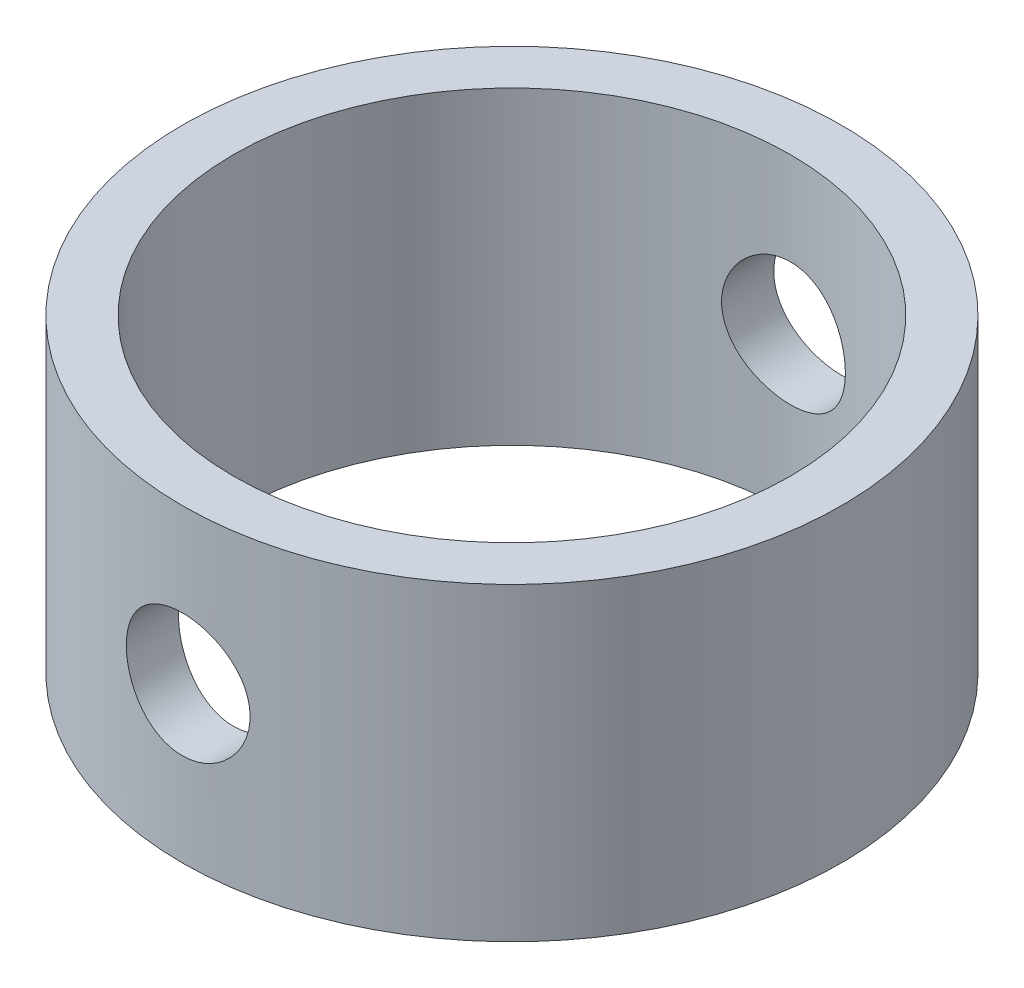
ISO-10303-21;
HEADER;
FILE_DESCRIPTION(('STEP AP214'),'2;1');
FILE_NAME('part.step','',(''),(''),'','','');
FILE_SCHEMA(('AUTOMOTIVE_DESIGN { 1 0 10303 214 1 1 1 1 }'));
ENDSEC;
DATA;
#1=APPLICATION_CONTEXT('core data for automotive mechanical design processes');
#2=APPLICATION_PROTOCOL_DEFINITION('international standard','automotive_design',2000,#1);
#3=PRODUCT_CONTEXT('',#1,'mechanical');
#4=PRODUCT('Part','Part','',(#3));
#5=PRODUCT_RELATED_PRODUCT_CATEGORY('part','',(#4));
#6=PRODUCT_DEFINITION_FORMATION('','',#4);
#7=PRODUCT_DEFINITION_CONTEXT('part definition',#1,'design');
#8=PRODUCT_DEFINITION('design','',#6,#7);
#9=PRODUCT_DEFINITION_SHAPE('','',#8);
#10=(LENGTH_UNIT() NAMED_UNIT(*) SI_UNIT(.MILLI.,.METRE.));
#11=(NAMED_UNIT(*) PLANE_ANGLE_UNIT() SI_UNIT($,.RADIAN.));
#12=(NAMED_UNIT(*) SI_UNIT($,.STERADIAN.) SOLID_ANGLE_UNIT());
#13=UNCERTAINTY_MEASURE_WITH_UNIT(LENGTH_MEASURE(1.E-05),#10,'distance_accuracy_value','');
#14=(GEOMETRIC_REPRESENTATION_CONTEXT(3) GLOBAL_UNCERTAINTY_ASSIGNED_CONTEXT((#13)) GLOBAL_UNIT_ASSIGNED_CONTEXT((#10,
#11,#12)) REPRESENTATION_CONTEXT('',''));
#15=CARTESIAN_POINT('',(0.,0.,0.));
#16=DIRECTION('',(0.,0.,1.));
#17=DIRECTION('',(1.,0.,0.));
#18=AXIS2_PLACEMENT_3D('',#15,#16,#17);
#19=CARTESIAN_POINT('',(0.,-12.7,0.));
#20=DIRECTION('',(0.,1.,0.));
#21=DIRECTION('',(0.,0.,1.));
#22=AXIS2_PLACEMENT_3D('',#19,#20,#21);
#23=CYLINDRICAL_SURFACE('',#22,27.051);
#24=CARTESIAN_POINT('',(5.08000000000002,0.,-26.5697233896028));
#25=CARTESIAN_POINT('',(5.08000256708206,0.141364499653391,-26.569722073654));
#26=CARTESIAN_POINT('',(5.07409757773334,0.282695961559386,-26.5708537218471));
#27=CARTESIAN_POINT('',(5.05052876680062,0.564382181343795,-26.575344123244));
#28=CARTESIAN_POINT('',(5.03286282437892,0.704736758448317,-26.578703278131));
#29=CARTESIAN_POINT('',(4.98589363700969,0.983492781243934,-26.5875540940278));
#30=CARTESIAN_POINT('',(4.95658382509998,1.12189307906085,-26.5930469583778));
#31=CARTESIAN_POINT('',(4.88654366566619,1.39573302550176,-26.6060060896126));
#32=CARTESIAN_POINT('',(4.84580911834365,1.5311715655926,-26.6134730821403));
#33=CARTESIAN_POINT('',(4.75329602318644,1.79790946590104,-26.630151742734));
#34=CARTESIAN_POINT('',(4.70153208780393,1.92921404143337,-26.6393611006094));
#35=CARTESIAN_POINT('',(4.58729153600577,2.18701672087562,-26.6592707738279));
#36=CARTESIAN_POINT('',(4.52481096907546,2.31351303121343,-26.6699716387178));
#37=CARTESIAN_POINT('',(4.38963277045323,2.56073489219014,-26.6925535716701));
#38=CARTESIAN_POINT('',(4.31693988138805,2.68146308687612,-26.7044340911514));
#39=CARTESIAN_POINT('',(4.16179669605856,2.91644956457912,-26.7290519457029));
#40=CARTESIAN_POINT('',(4.07934276225639,3.03070541201994,-26.7417895994235));
#41=CARTESIAN_POINT('',(3.90432108769642,3.25314005445945,-26.7679059367961));
#42=CARTESIAN_POINT('',(3.81165353523558,3.36123968526744,-26.7812900666289));
#43=CARTESIAN_POINT('',(3.61754912714749,3.5693120823927,-26.8081991248317));
#44=CARTESIAN_POINT('',(3.51610903532487,3.66928182297248,-26.8217241035287));
#45=CARTESIAN_POINT('',(3.30520972923538,3.86034036637162,-26.8485284984068));
#46=CARTESIAN_POINT('',(3.1957529323633,3.95143182723533,-26.8618079871138));
#47=CARTESIAN_POINT('',(2.96949244095228,4.12417028590855,-26.8877608808108));
#48=CARTESIAN_POINT('',(2.85268605350478,4.20581379048774,-26.9004340606183));
#49=CARTESIAN_POINT('',(2.61167743929262,4.35960112494206,-26.9249051052745));
#50=CARTESIAN_POINT('',(2.48742746808577,4.43167129505857,-26.9366959088031));
#51=CARTESIAN_POINT('',(2.23313348827631,4.56510058505793,-26.9589691141148));
#52=CARTESIAN_POINT('',(2.10308733260354,4.62645569368581,-26.9694510254887));
#53=CARTESIAN_POINT('',(1.83820533386735,4.73793495022989,-26.9887977985633));
#54=CARTESIAN_POINT('',(1.70337159992896,4.78806397429081,-26.9976633620263));
#55=CARTESIAN_POINT('',(1.42983010742645,4.87675092762048,-27.0135340983942));
#56=CARTESIAN_POINT('',(1.29112095881313,4.91530464522659,-27.0205385940453));
#57=CARTESIAN_POINT('',(0.874048313276515,5.01229063347215,-27.0382882207487));
#58=CARTESIAN_POINT('',(0.59131839076699,5.05348134717586,-27.0460266617099));
#59=CARTESIAN_POINT('',(0.0230176547578063,5.08792837752833,-27.0524852882493));
#60=CARTESIAN_POINT('',(-0.262552914025349,5.08118878817784,-27.0512062440624));
#61=CARTESIAN_POINT('',(-0.824829661191678,5.02045528014284,-27.0398652579797));
#62=CARTESIAN_POINT('',(-1.10160213153865,4.96705607949367,-27.0299138571623));
#63=CARTESIAN_POINT('',(-1.64217617562037,4.8154426096577,-27.0024661072227));
#64=CARTESIAN_POINT('',(-1.90597727515982,4.71722670345078,-26.9849694824972));
#65=CARTESIAN_POINT('',(-2.41485846254721,4.4782059153877,-26.944213575484));
#66=CARTESIAN_POINT('',(-2.65982425022026,4.33716333993054,-26.9209222657255));
#67=CARTESIAN_POINT('',(-3.12283270048111,4.01666683516913,-26.8711522678866));
#68=CARTESIAN_POINT('',(-3.34087261327621,3.83720898782981,-26.844673254808));
#69=CARTESIAN_POINT('',(-3.74736572397886,3.44169860390735,-26.7909799389666));
#70=CARTESIAN_POINT('',(-3.93531221759095,3.22512561840551,-26.7637605910953));
#71=CARTESIAN_POINT('',(-4.27229191544478,2.76326601836816,-26.7120436426619));
#72=CARTESIAN_POINT('',(-4.42132454674342,2.51797898114212,-26.6875460821767));
#73=CARTESIAN_POINT('',(-4.67639129553224,2.0049809622972,-26.6440390319752));
#74=CARTESIAN_POINT('',(-4.78235157764922,1.73723241641905,-26.6250389821175));
#75=CARTESIAN_POINT('',(-4.94763995229856,1.187295721939,-26.5948226204595));
#76=CARTESIAN_POINT('',(-5.00697334654203,0.90510921889272,-26.5836054237269));
#77=CARTESIAN_POINT('',(-5.07658346567403,0.338876603192544,-26.5703999364478));
#78=CARTESIAN_POINT('',(-5.08758826268491,0.0549230976905211,-26.5682746881088));
#79=CARTESIAN_POINT('',(-5.0621806505023,-0.510764089258362,-26.5731272035377));
#80=CARTESIAN_POINT('',(-5.02577059405315,-0.792497880150504,-26.5801045156328));
#81=CARTESIAN_POINT('',(-4.90719193131747,-1.34335340767062,-26.6022483908177));
#82=CARTESIAN_POINT('',(-4.82540517806713,-1.61256033845273,-26.6173465832843));
#83=CARTESIAN_POINT('',(-4.61879991229669,-2.1334495672131,-26.6539721004234));
#84=CARTESIAN_POINT('',(-4.49397821959821,-2.3851305684148,-26.6754999002126));
#85=CARTESIAN_POINT('',(-4.20317148850041,-2.86703065287115,-26.7228707863097));
#86=CARTESIAN_POINT('',(-4.0367266202318,-3.09696753142418,-26.7487609465102));
#87=CARTESIAN_POINT('',(-3.66801717449464,-3.52591122782488,-26.8018069970378));
#88=CARTESIAN_POINT('',(-3.4657493658374,-3.72491525252125,-26.8289630013799));
#89=CARTESIAN_POINT('',(-3.02788737421985,-4.08906555737973,-26.8819212976269));
#90=CARTESIAN_POINT('',(-2.79188273223284,-4.25372212292572,-26.9077005583733));
#91=CARTESIAN_POINT('',(-2.29512614515766,-4.54104567865458,-26.9546122838539));
#92=CARTESIAN_POINT('',(-2.03437515541529,-4.66371428896301,-26.9757449278687));
#93=CARTESIAN_POINT('',(-1.49693379453581,-4.86285166670497,-27.0108854823111));
#94=CARTESIAN_POINT('',(-1.22033474137935,-4.93956068217446,-27.0249303811005));
#95=CARTESIAN_POINT('',(-0.657731159084833,-5.04535136070028,-27.0444627404478));
#96=CARTESIAN_POINT('',(-0.371727626097858,-5.07443805158678,-27.0499511043775));
#97=CARTESIAN_POINT('',(0.0554080703937297,-5.08166432390422,-27.0513147306629));
#98=CARTESIAN_POINT('',(0.196452423067438,-5.07816043934217,-27.0506536333614));
#99=CARTESIAN_POINT('',(0.477720775477603,-5.05944729260677,-27.0471457169919));
#100=CARTESIAN_POINT('',(0.617945064979942,-5.04424245270367,-27.0442997236866));
#101=CARTESIAN_POINT('',(0.896624778833353,-5.00223345673672,-27.0364961488673));
#102=CARTESIAN_POINT('',(1.03507956678128,-4.97542524201215,-27.0315378285072));
#103=CARTESIAN_POINT('',(1.30915523943449,-4.91043148254133,-27.0196505689666));
#104=CARTESIAN_POINT('',(1.44477712151584,-4.87225001674715,-27.0127223363243));
#105=CARTESIAN_POINT('',(1.71209617462916,-4.78485881709987,-26.997096724828));
#106=CARTESIAN_POINT('',(1.84379871098829,-4.7356650272703,-26.9884019053641));
#107=CARTESIAN_POINT('',(2.10253584930964,-4.62660198135007,-26.9694784045542));
#108=CARTESIAN_POINT('',(2.22957209340055,-4.56673652501873,-26.959250269367));
#109=CARTESIAN_POINT('',(2.47822087568244,-4.4367231080215,-26.9375315398434));
#110=CARTESIAN_POINT('',(2.59983119948128,-4.36657099840115,-26.9260404365799));
#111=CARTESIAN_POINT('',(2.83672368443914,-4.21652115979724,-26.9021146032735));
#112=CARTESIAN_POINT('',(2.9520080210297,-4.13662681189584,-26.8896802011691));
#113=CARTESIAN_POINT('',(3.17718344757182,-3.96637363161052,-26.8640119394122));
#114=CARTESIAN_POINT('',(3.28697010564954,-3.8758780146352,-26.8507690028723));
#115=CARTESIAN_POINT('',(3.49851447866629,-3.68605288681,-26.8240258542689));
#116=CARTESIAN_POINT('',(3.60027501869095,-3.58672651069182,-26.8105257348263));
#117=CARTESIAN_POINT('',(3.79518020656133,-3.37982514835551,-26.7836310923852));
#118=CARTESIAN_POINT('',(3.88831966421296,-3.27224526359186,-26.7702366373819));
#119=CARTESIAN_POINT('',(4.06524210713817,-3.04965754741676,-26.7439414759895));
#120=CARTESIAN_POINT('',(4.14902852229536,-2.93465246350498,-26.7310405897505));
#121=CARTESIAN_POINT('',(4.3074638568949,-2.69680725108129,-26.7059703792113));
#122=CARTESIAN_POINT('',(4.38201640649507,-2.57390202020515,-26.6938093514673));
#123=CARTESIAN_POINT('',(4.52045685768508,-2.32217495860341,-26.6707141991253));
#124=CARTESIAN_POINT('',(4.58434868678364,-2.19335532919965,-26.6597796231797));
#125=CARTESIAN_POINT('',(4.70098554312212,-1.9307407236786,-26.6394602610234));
#126=CARTESIAN_POINT('',(4.75373774384349,-1.79694901507337,-26.6300744783074));
#127=CARTESIAN_POINT('',(4.8477286781571,-1.52531565586259,-26.6131245855356));
#128=CARTESIAN_POINT('',(4.88896973584028,-1.38747482899134,-26.6055601078023));
#129=CARTESIAN_POINT('',(4.9758861164288,-1.04451436024711,-26.589470971455));
#130=CARTESIAN_POINT('',(5.01487810002878,-0.837607352946478,-26.5821046453276));
#131=CARTESIAN_POINT('',(5.06693277852335,-0.420442490786676,-26.5722318992123));
#132=CARTESIAN_POINT('',(5.07999618318998,-0.210184727810328,-26.5697253461924));
#133=CARTESIAN_POINT('',(5.08000000000002,0.,-26.5697233896028));
#134=B_SPLINE_CURVE_WITH_KNOTS('',3,(#24,#25,#26,#27,#28,#29,#30,#31,#32,#33,#34,#35,#36,#37,
#38,#39,#40,#41,#42,#43,#44,#45,#46,#47,#48,#49,#50,#51,#52,#53,#54,#55,#56,#57,#58,#59,#60,#61,
#62,#63,#64,#65,#66,#67,#68,#69,#70,#71,#72,#73,#74,#75,#76,#77,#78,#79,#80,#81,#82,#83,#84,#85,
#86,#87,#88,#89,#90,#91,#92,#93,#94,#95,#96,#97,#98,#99,#100,#101,#102,#103,#104,#105,#106,#107,
#108,#109,#110,#111,#112,#113,#114,#115,#116,#117,#118,#119,#120,#121,#122,#123,#124,#125,#126,
#127,#128,#129,#130,#131,#132,#133),.UNSPECIFIED.,.T.,.F.,(4,2,2,2,2,2,2,2,2,2,2,2,2,2,2,2,2,2,
2,2,2,2,2,2,2,2,2,2,2,2,2,2,2,2,2,2,2,2,2,2,2,2,2,2,2,2,2,2,2,2,2,2,2,2,4),(0.,
0.423908911598091,0.847894286864987,1.27211912356616,1.69650011261809,2.12032231179116,
2.54430108334431,2.96808360505442,3.39202455309994,3.82055424178395,4.2492426952525,
4.67780240803715,5.10652007103647,5.53836582317089,5.97037289471618,6.4021919548047,
6.83416794191157,7.68710968204359,8.5399785684283,9.38213289548187,10.2243179863751,
11.0712655079208,11.9182994521921,12.778362750594,13.6384387113101,14.499982874108,
15.3614290608316,16.2098520084506,17.0582328585819,17.8995804043814,18.7409901370692,
19.5921411183092,20.4433689115413,21.3060094052935,22.1686166098914,23.0266743837271,
23.8846415604102,24.3074972051029,24.7301931137694,25.1530369938221,25.5757294055285,
25.9978137418792,26.4197480897533,26.8418530884946,27.2638120087584,27.6919852208579,
28.1200070428486,28.5482848953963,28.9764051732761,29.4086723568476,29.8407799358519,
30.2726084002869,30.7043496157173,31.3346466035121,31.9649263372436),.UNSPECIFIED.);
#135=CARTESIAN_POINT('',(5.08000000000002,0.,-26.5697233896028));
#136=VERTEX_POINT('',#135);
#137=EDGE_CURVE('E91',#136,#136,#134,.T.);
#138=ORIENTED_EDGE('',*,*,#137,.T.);
#139=EDGE_LOOP('',(#138));
#140=FACE_BOUND('',#139,.T.);
#141=CARTESIAN_POINT('',(0.,12.7,0.));
#142=DIRECTION('',(0.,1.,0.));
#143=DIRECTION('',(0.,0.,1.));
#144=AXIS2_PLACEMENT_3D('',#141,#142,#143);
#145=CIRCLE('',#144,27.051);
#146=CARTESIAN_POINT('',(0.,12.7,27.0510000000001));
#147=VERTEX_POINT('',#146);
#148=EDGE_CURVE('E49',#147,#147,#145,.T.);
#149=ORIENTED_EDGE('',*,*,#148,.F.);
#150=EDGE_LOOP('',(#149));
#151=FACE_BOUND('',#150,.T.);
#152=CARTESIAN_POINT('',(0.,-12.7,0.));
#153=DIRECTION('',(0.,1.,0.));
#154=DIRECTION('',(0.,0.,1.));
#155=AXIS2_PLACEMENT_3D('',#152,#153,#154);
#156=CIRCLE('',#155,27.051);
#157=CARTESIAN_POINT('',(0.,-12.7,27.0510000000001));
#158=VERTEX_POINT('',#157);
#159=EDGE_CURVE('E10',#158,#158,#156,.T.);
#160=ORIENTED_EDGE('',*,*,#159,.T.);
#161=EDGE_LOOP('',(#160));
#162=FACE_BOUND('',#161,.T.);
#163=CARTESIAN_POINT('',(-5.07999999999999,0.,26.5697233896029));
#164=CARTESIAN_POINT('',(-5.08000256708203,-0.14136449965339,26.5697220736542));
#165=CARTESIAN_POINT('',(-5.07409757773327,-0.282695961559385,26.5708537218471));
#166=CARTESIAN_POINT('',(-5.05052876680054,-0.564382181343792,26.575344123244));
#167=CARTESIAN_POINT('',(-5.03286282437884,-0.704736758448312,26.578703278131));
#168=CARTESIAN_POINT('',(-4.98589363700962,-0.983492781243932,26.5875540940278));
#169=CARTESIAN_POINT('',(-4.95658382509992,-1.12189307906086,26.5930469583778));
#170=CARTESIAN_POINT('',(-4.88654366566611,-1.39573302550176,26.6060060896126));
#171=CARTESIAN_POINT('',(-4.84580911834354,-1.5311715655926,26.6134730821402));
#172=CARTESIAN_POINT('',(-4.75329602318633,-1.79790946590104,26.630151742734));
#173=CARTESIAN_POINT('',(-4.70153208780385,-1.92921404143337,26.6393611006094));
#174=CARTESIAN_POINT('',(-4.58729153600571,-2.18701672087562,26.6592707738279));
#175=CARTESIAN_POINT('',(-4.52481096907539,-2.31351303121343,26.6699716387178));
#176=CARTESIAN_POINT('',(-4.38963277045316,-2.56073489219014,26.6925535716701));
#177=CARTESIAN_POINT('',(-4.31693988138797,-2.6814630868761,26.7044340911514));
#178=CARTESIAN_POINT('',(-4.16179669605851,-2.91644956457912,26.7290519457029));
#179=CARTESIAN_POINT('',(-4.07934276225639,-3.03070541201995,26.7417895994235));
#180=CARTESIAN_POINT('',(-3.90432108769642,-3.25314005445946,26.7679059367961));
#181=CARTESIAN_POINT('',(-3.81165353523554,-3.36123968526743,26.7812900666289));
#182=CARTESIAN_POINT('',(-3.61754912714742,-3.56931208239268,26.8081991248317));
#183=CARTESIAN_POINT('',(-3.51610903532481,-3.66928182297247,26.8217241035287));
#184=CARTESIAN_POINT('',(-3.30520972923532,-3.86034036637162,26.8485284984068));
#185=CARTESIAN_POINT('',(-3.19575293236323,-3.95143182723534,26.8618079871138));
#186=CARTESIAN_POINT('',(-2.9694924409522,-4.12417028590856,26.8877608808108));
#187=CARTESIAN_POINT('',(-2.85268605350469,-4.20581379048774,26.9004340606184));
#188=CARTESIAN_POINT('',(-2.61167743929252,-4.35960112494206,26.9249051052746));
#189=CARTESIAN_POINT('',(-2.48742746808567,-4.43167129505859,26.9366959088032));
#190=CARTESIAN_POINT('',(-2.23313348827621,-4.56510058505795,26.9589691141148));
#191=CARTESIAN_POINT('',(-2.10308733260344,-4.62645569368582,26.9694510254887));
#192=CARTESIAN_POINT('',(-1.83820533386725,-4.7379349502299,26.9887977985634));
#193=CARTESIAN_POINT('',(-1.70337159992886,-4.78806397429083,26.9976633620263));
#194=CARTESIAN_POINT('',(-1.42983010742635,-4.87675092762048,27.0135340983942));
#195=CARTESIAN_POINT('',(-1.29112095881304,-4.91530464522659,27.0205385940453));
#196=CARTESIAN_POINT('',(-0.874048313276421,-5.01229063347214,27.0382882207487));
#197=CARTESIAN_POINT('',(-0.591318390766901,-5.05348134717586,27.0460266617099));
#198=CARTESIAN_POINT('',(-0.0230176547577271,-5.08792837752833,27.0524852882493));
#199=CARTESIAN_POINT('',(0.262552914025424,-5.08118878817783,27.0512062440625));
#200=CARTESIAN_POINT('',(0.824829661191746,-5.02045528014283,27.0398652579798));
#201=CARTESIAN_POINT('',(1.10160213153872,-4.96705607949367,27.0299138571623));
#202=CARTESIAN_POINT('',(1.64217617562044,-4.8154426096577,27.0024661072226));
#203=CARTESIAN_POINT('',(1.90597727515989,-4.71722670345079,26.9849694824972));
#204=CARTESIAN_POINT('',(2.41485846254729,-4.47820591538769,26.944213575484));
#205=CARTESIAN_POINT('',(2.65982425022035,-4.33716333993052,26.9209222657255));
#206=CARTESIAN_POINT('',(3.12283270048122,-4.01666683516912,26.8711522678866));
#207=CARTESIAN_POINT('',(3.34087261327635,-3.83720898782981,26.8446732548079));
#208=CARTESIAN_POINT('',(3.74736572397899,-3.44169860390736,26.7909799389665));
#209=CARTESIAN_POINT('',(3.93531221759105,-3.22512561840551,26.7637605910953));
#210=CARTESIAN_POINT('',(4.27229191544482,-2.76326601836815,26.7120436426619));
#211=CARTESIAN_POINT('',(4.42132454674343,-2.51797898114211,26.6875460821768));
#212=CARTESIAN_POINT('',(4.67639129553225,-2.00498096229719,26.6440390319753));
#213=CARTESIAN_POINT('',(4.78235157764926,-1.73723241641905,26.6250389821175));
#214=CARTESIAN_POINT('',(4.94763995229866,-1.187295721939,26.5948226204595));
#215=CARTESIAN_POINT('',(5.00697334654216,-0.905109218892723,26.5836054237269));
#216=CARTESIAN_POINT('',(5.07658346567416,-0.338876603192546,26.5703999364478));
#217=CARTESIAN_POINT('',(5.087588262685,-0.0549230976905234,26.5682746881088));
#218=CARTESIAN_POINT('',(5.06218065050235,0.510764089258358,26.5731272035376));
#219=CARTESIAN_POINT('',(5.02577059405317,0.7924978801505,26.5801045156327));
#220=CARTESIAN_POINT('',(4.9071919313175,1.34335340767062,26.6022483908176));
#221=CARTESIAN_POINT('',(4.82540517806718,1.61256033845274,26.6173465832843));
#222=CARTESIAN_POINT('',(4.61879991229676,2.13344956721311,26.6539721004234));
#223=CARTESIAN_POINT('',(4.49397821959828,2.3851305684148,26.6754999002127));
#224=CARTESIAN_POINT('',(4.20317148850048,2.86703065287115,26.7228707863098));
#225=CARTESIAN_POINT('',(4.03672662023186,3.09696753142419,26.7487609465102));
#226=CARTESIAN_POINT('',(3.6680171744947,3.52591122782489,26.8018069970378));
#227=CARTESIAN_POINT('',(3.46574936583745,3.72491525252125,26.8289630013799));
#228=CARTESIAN_POINT('',(3.0278873742199,4.08906555737973,26.8819212976269));
#229=CARTESIAN_POINT('',(2.7918827322329,4.25372212292573,26.9077005583733));
#230=CARTESIAN_POINT('',(2.29512614515772,4.54104567865459,26.9546122838539));
#231=CARTESIAN_POINT('',(2.03437515541535,4.66371428896302,26.9757449278687));
#232=CARTESIAN_POINT('',(1.49693379453587,4.86285166670497,27.0108854823112));
#233=CARTESIAN_POINT('',(1.22033474137943,4.93956068217445,27.0249303811005));
#234=CARTESIAN_POINT('',(0.657731159084935,5.04535136070028,27.0444627404478));
#235=CARTESIAN_POINT('',(0.371727626097971,5.07443805158678,27.0499511043775));
#236=CARTESIAN_POINT('',(-0.0554080703936131,5.08166432390422,27.0513147306629));
#237=CARTESIAN_POINT('',(-0.19645242306733,5.07816043934217,27.0506536333614));
#238=CARTESIAN_POINT('',(-0.477720775477511,5.05944729260677,27.0471457169919));
#239=CARTESIAN_POINT('',(-0.617945064979859,5.04424245270367,27.0442997236866));
#240=CARTESIAN_POINT('',(-0.896624778833288,5.00223345673672,27.0364961488673));
#241=CARTESIAN_POINT('',(-1.03507956678122,4.97542524201214,27.0315378285073));
#242=CARTESIAN_POINT('',(-1.30915523943445,4.91043148254132,27.0196505689665));
#243=CARTESIAN_POINT('',(-1.44477712151581,4.87225001674716,27.0127223363242));
#244=CARTESIAN_POINT('',(-1.71209617462913,4.78485881709988,26.9970967248279));
#245=CARTESIAN_POINT('',(-1.84379871098826,4.73566502727029,26.988401905364));
#246=CARTESIAN_POINT('',(-2.10253584930962,4.62660198135005,26.9694784045543));
#247=CARTESIAN_POINT('',(-2.22957209340053,4.56673652501871,26.959250269367));
#248=CARTESIAN_POINT('',(-2.47822087568241,4.43672310802148,26.9375315398434));
#249=CARTESIAN_POINT('',(-2.59983119948125,4.36657099840112,26.92604043658));
#250=CARTESIAN_POINT('',(-2.83672368443911,4.21652115979722,26.9021146032734));
#251=CARTESIAN_POINT('',(-2.95200802102967,4.13662681189584,26.8896802011689));
#252=CARTESIAN_POINT('',(-3.17718344757178,3.96637363161052,26.864011939412));
#253=CARTESIAN_POINT('',(-3.2869701056495,3.87587801463518,26.8507690028723));
#254=CARTESIAN_POINT('',(-3.49851447866624,3.68605288680996,26.824025854269));
#255=CARTESIAN_POINT('',(-3.60027501869091,3.58672651069179,26.8105257348263));
#256=CARTESIAN_POINT('',(-3.79518020656128,3.37982514835549,26.7836310923852));
#257=CARTESIAN_POINT('',(-3.88831966421291,3.27224526359184,26.7702366373819));
#258=CARTESIAN_POINT('',(-4.06524210713811,3.04965754741674,26.7439414759895));
#259=CARTESIAN_POINT('',(-4.14902852229531,2.93465246350498,26.7310405897504));
#260=CARTESIAN_POINT('',(-4.30746385689485,2.69680725108129,26.7059703792113));
#261=CARTESIAN_POINT('',(-4.382016406495,2.57390202020515,26.6938093514673));
#262=CARTESIAN_POINT('',(-4.52045685768501,2.3221749586034,26.6707141991253));
#263=CARTESIAN_POINT('',(-4.58434868678357,2.19335532919964,26.6597796231798));
#264=CARTESIAN_POINT('',(-4.70098554312205,1.9307407236786,26.6394602610234));
#265=CARTESIAN_POINT('',(-4.75373774384342,1.79694901507338,26.6300744783073));
#266=CARTESIAN_POINT('',(-4.84772867815703,1.52531565586259,26.6131245855356));
#267=CARTESIAN_POINT('',(-4.8889697358402,1.38747482899134,26.6055601078024));
#268=CARTESIAN_POINT('',(-4.97588611642872,1.04451436024711,26.5894709714551));
#269=CARTESIAN_POINT('',(-5.01487810002869,0.837607352946474,26.5821046453276));
#270=CARTESIAN_POINT('',(-5.0669327785233,0.420442490786675,26.5722318992123));
#271=CARTESIAN_POINT('',(-5.07999618318996,0.210184727810326,26.5697253461926));
#272=CARTESIAN_POINT('',(-5.07999999999999,0.,26.5697233896029));
#273=B_SPLINE_CURVE_WITH_KNOTS('',3,(#163,#164,#165,#166,#167,#168,#169,#170,#171,#172,#173,
#174,#175,#176,#177,#178,#179,#180,#181,#182,#183,#184,#185,#186,#187,#188,#189,#190,#191,#192,
#193,#194,#195,#196,#197,#198,#199,#200,#201,#202,#203,#204,#205,#206,#207,#208,#209,#210,#211,
#212,#213,#214,#215,#216,#217,#218,#219,#220,#221,#222,#223,#224,#225,#226,#227,#228,#229,#230,
#231,#232,#233,#234,#235,#236,#237,#238,#239,#240,#241,#242,#243,#244,#245,#246,#247,#248,#249,
#250,#251,#252,#253,#254,#255,#256,#257,#258,#259,#260,#261,#262,#263,#264,#265,#266,#267,#268,
#269,#270,#271,#272),.UNSPECIFIED.,.T.,.F.,(4,2,2,2,2,2,2,2,2,2,2,2,2,2,2,2,2,2,2,2,2,2,2,2,2,2,
2,2,2,2,2,2,2,2,2,2,2,2,2,2,2,2,2,2,2,2,2,2,2,2,2,2,2,2,4),(0.,0.42390891159809,
0.847894286864983,1.27211912356616,1.6965001126181,2.12032231179116,2.54430108334431,
2.9680836050544,3.3920245530999,3.82055424178393,4.24924269525249,4.67780240803717,
5.10652007103651,5.53836582317092,5.97037289471622,6.40219195480473,6.8341679419116,
7.68710968204361,8.5399785684283,9.38213289548186,10.2243179863751,11.0712655079209,
11.9182994521921,12.778362750594,13.6384387113101,14.499982874108,15.3614290608316,
16.2098520084506,17.0582328585819,17.8995804043814,18.7409901370692,19.5921411183092,
20.4433689115413,21.3060094052935,22.1686166098915,23.0266743837271,23.8846415604101,
24.3074972051029,24.7301931137694,25.1530369938221,25.5757294055286,25.9978137418793,
26.4197480897533,26.8418530884947,27.2638120087584,27.691985220858,28.1200070428487,
28.5482848953963,28.9764051732761,29.4086723568476,29.8407799358519,30.2726084002869,
30.7043496157173,31.3346466035122,31.9649263372436),.UNSPECIFIED.);
#274=CARTESIAN_POINT('',(-5.07999999999999,0.,26.5697233896029));
#275=VERTEX_POINT('',#274);
#276=EDGE_CURVE('E60',#275,#275,#273,.T.);
#277=ORIENTED_EDGE('',*,*,#276,.F.);
#278=EDGE_LOOP('',(#277));
#279=FACE_BOUND('',#278,.T.);
#280=ADVANCED_FACE('F36',(#140,#151,#162,#279),#23,.T.);
#281=CARTESIAN_POINT('',(0.,-12.7,0.));
#282=DIRECTION('',(0.,1.,0.));
#283=DIRECTION('',(0.,0.,1.));
#284=AXIS2_PLACEMENT_3D('',#281,#282,#283);
#285=CYLINDRICAL_SURFACE('',#284,22.86);
#286=CARTESIAN_POINT('',(5.08,0.,-22.288409543976));
#287=CARTESIAN_POINT('',(5.07999047367789,0.28153961399861,-22.2884152312016));
#288=CARTESIAN_POINT('',(5.05651549389989,0.563192708152524,-22.2938021321399));
#289=CARTESIAN_POINT('',(4.96334348112367,1.11848093826572,-22.3147264919059));
#290=CARTESIAN_POINT('',(4.89361372561626,1.39211025467659,-22.3302711366183));
#291=CARTESIAN_POINT('',(4.71024301313196,1.92323827256494,-22.3696655063698));
#292=CARTESIAN_POINT('',(4.5966511267355,2.18075462756098,-22.3935059475846));
#293=CARTESIAN_POINT('',(4.32892208725692,2.67308331792509,-22.4467944842288));
#294=CARTESIAN_POINT('',(4.17478549384169,2.90789596662707,-22.4762425022512));
#295=CARTESIAN_POINT('',(3.8274779294618,3.35224773127573,-22.5380017433978));
#296=CARTESIAN_POINT('',(3.6337333923922,3.56133339578411,-22.5703505875779));
#297=CARTESIAN_POINT('',(3.21394754431366,3.94432219119513,-22.6339375475578));
#298=CARTESIAN_POINT('',(2.98790367471455,4.11822253225487,-22.6651755751193));
#299=CARTESIAN_POINT('',(2.50688842090342,4.4277045085441,-22.7234316371639));
#300=CARTESIAN_POINT('',(2.25162926999402,4.56284901361093,-22.7504001025488));
#301=CARTESIAN_POINT('',(1.72132329255597,4.78815349637002,-22.7966530181213));
#302=CARTESIAN_POINT('',(1.44627876353771,4.87831868751638,-22.8159383587908));
#303=CARTESIAN_POINT('',(0.888925822674037,5.00967611966469,-22.8443862254682));
#304=CARTESIAN_POINT('',(0.606806579785341,5.05163609736901,-22.8537072751441));
#305=CARTESIAN_POINT('',(0.0393894507765458,5.08779340801595,-22.8617259033818));
#306=CARTESIAN_POINT('',(-0.245908056510384,5.08199637379189,-22.8604247348108));
#307=CARTESIAN_POINT('',(-0.806287239173196,5.02337394486009,-22.8474663535223));
#308=CARTESIAN_POINT('',(-1.08146033219091,4.97137619110865,-22.8359914019582));
#309=CARTESIAN_POINT('',(-1.61907434768023,4.82314842440987,-22.8041829234791));
#310=CARTESIAN_POINT('',(-1.88151468182671,4.72691636973663,-22.7838489876614));
#311=CARTESIAN_POINT('',(-2.38849857425285,4.49222628578371,-22.7363156805819));
#312=CARTESIAN_POINT('',(-2.63289293307058,4.35345657997755,-22.7090658988343));
#313=CARTESIAN_POINT('',(-3.09522656682394,4.03786316136919,-22.6506855007807));
#314=CARTESIAN_POINT('',(-3.31316212303962,3.86103410908081,-22.6195543401998));
#315=CARTESIAN_POINT('',(-3.72131587353456,3.46984270761501,-22.5560424094361));
#316=CARTESIAN_POINT('',(-3.91083855492697,3.25475606103979,-22.5236491602921));
#317=CARTESIAN_POINT('',(-4.25125649672445,2.79551702104693,-22.4618885647179));
#318=CARTESIAN_POINT('',(-4.40215064066947,2.55136378783195,-22.432521305761));
#319=CARTESIAN_POINT('',(-4.66135125425858,2.03977268361077,-22.3801034121955));
#320=CARTESIAN_POINT('',(-4.76952252696271,1.77226411414576,-22.3570728989307));
#321=CARTESIAN_POINT('',(-4.93916384585617,1.22223232501494,-22.3202122568124));
#322=CARTESIAN_POINT('',(-5.00064156512187,0.939711580443438,-22.3063806163695));
#323=CARTESIAN_POINT('',(-5.07406399207373,0.374040432843349,-22.2897930756174));
#324=CARTESIAN_POINT('',(-5.08702306870319,0.0910281871373733,-22.2868103967558));
#325=CARTESIAN_POINT('',(-5.06578990457561,-0.473112904332455,-22.2916461571674));
#326=CARTESIAN_POINT('',(-5.03160101596522,-0.754241882565719,-22.2994638285527));
#327=CARTESIAN_POINT('',(-4.91792354799788,-1.30307978523382,-22.3248049386566));
#328=CARTESIAN_POINT('',(-4.83899699342299,-1.57091119725058,-22.342207885319));
#329=CARTESIAN_POINT('',(-4.6386946885232,-2.08954784306887,-22.3846493759229));
#330=CARTESIAN_POINT('',(-4.51731476799421,-2.34035140132916,-22.4096886699537));
#331=CARTESIAN_POINT('',(-4.23332834223041,-2.82219298851157,-22.4650776009463));
#332=CARTESIAN_POINT('',(-4.07009890755946,-3.05285474006194,-22.4955051141663));
#333=CARTESIAN_POINT('',(-3.70785908906177,-3.48388522781824,-22.5580382471257));
#334=CARTESIAN_POINT('',(-3.50884411140852,-3.68425006869263,-22.5901440819372));
#335=CARTESIAN_POINT('',(-3.07608532512109,-4.05295441251177,-22.6531661217547));
#336=CARTESIAN_POINT('',(-2.84174542098411,-4.22060125110842,-22.6840474113811));
#337=CARTESIAN_POINT('',(-2.34764113184216,-4.51414930095443,-22.7404907506628));
#338=CARTESIAN_POINT('',(-2.08787795482517,-4.64005249440896,-22.7660530528697));
#339=CARTESIAN_POINT('',(-1.55194482600837,-4.84558369116886,-22.8088314134776));
#340=CARTESIAN_POINT('',(-1.27589378596299,-4.92551007757118,-22.8261011655522));
#341=CARTESIAN_POINT('',(-0.7138545204608,-5.03774750644199,-22.8505810881676));
#342=CARTESIAN_POINT('',(-0.427867795329976,-5.07006570621316,-22.857792770806));
#343=CARTESIAN_POINT('',(0.139356707672544,-5.08583890721716,-22.8612973100871));
#344=CARTESIAN_POINT('',(0.42056483256994,-5.07032674187453,-22.8578209652544));
#345=CARTESIAN_POINT('',(0.976259265070024,-4.99319562558586,-22.8408363721633));
#346=CARTESIAN_POINT('',(1.25074570105196,-4.93157755593861,-22.8273283156577));
#347=CARTESIAN_POINT('',(1.78437612335807,-4.76448537272543,-22.791817181437));
#348=CARTESIAN_POINT('',(2.04356940190698,-4.65916207129219,-22.7698433348125));
#349=CARTESIAN_POINT('',(2.5407404813563,-4.4077945790098,-22.7197434178724));
#350=CARTESIAN_POINT('',(2.77871614890838,-4.26174629950223,-22.6916167298921));
#351=CARTESIAN_POINT('',(3.23172048475534,-3.9297298152438,-22.6315900584347));
#352=CARTESIAN_POINT('',(3.44621042631806,-3.74303788934882,-22.5996271269518));
#353=CARTESIAN_POINT('',(3.84117020017682,-3.33648777341103,-22.5358631623133));
#354=CARTESIAN_POINT('',(4.02163178397831,-3.11662156509317,-22.5040621702248));
#355=CARTESIAN_POINT('',(4.3458346190064,-2.6462875705386,-22.4437288022287));
#356=CARTESIAN_POINT('',(4.48903054079255,-2.39543687347865,-22.415248009314));
#357=CARTESIAN_POINT('',(4.73100466864656,-1.87264828575723,-22.3654325407368));
#358=CARTESIAN_POINT('',(4.82981992564187,-1.60072820797164,-22.3440919079659));
#359=CARTESIAN_POINT('',(4.96288947642972,-1.10716955589966,-22.3148555922063));
#360=CARTESIAN_POINT('',(5.00672054401883,-0.888178494725339,-22.3050050346657));
#361=CARTESIAN_POINT('',(5.06527882473345,-0.446148570286355,-22.2917799252447));
#362=CARTESIAN_POINT('',(5.08000754926425,-0.223109917837044,-22.2884050370562));
#363=CARTESIAN_POINT('',(5.08,0.,-22.288409543976));
#364=B_SPLINE_CURVE_WITH_KNOTS('',3,(#286,#287,#288,#289,#290,#291,#292,#293,#294,#295,#296,
#297,#298,#299,#300,#301,#302,#303,#304,#305,#306,#307,#308,#309,#310,#311,#312,#313,#314,#315,
#316,#317,#318,#319,#320,#321,#322,#323,#324,#325,#326,#327,#328,#329,#330,#331,#332,#333,#334,
#335,#336,#337,#338,#339,#340,#341,#342,#343,#344,#345,#346,#347,#348,#349,#350,#351,#352,#353,
#354,#355,#356,#357,#358,#359,#360,#361,#362,#363),.UNSPECIFIED.,.T.,.F.,(4,2,2,2,2,2,2,2,2,2,2,
2,2,2,2,2,2,2,2,2,2,2,2,2,2,2,2,2,2,2,2,2,2,2,2,2,2,2,4),(0.,0.843800997232452,1.68819957113255,
2.53165620179761,3.37510119025267,4.23175668555893,5.0884800784501,5.95451724112734,
6.82045399999093,7.6723994755663,8.52424446750646,9.36113042275914,10.1980550100983,
11.0412646333649,11.8845926308202,12.7460260013687,13.6074842666569,14.4716471920553,
15.3356680802104,16.181520837791,17.0273134596631,17.8627089520477,18.6981865285854,
19.5469060097684,20.3957345198163,21.2609441696058,22.1261127288594,22.9856012082732,
23.8449604610211,24.6858939242577,25.5268113137455,26.3648507952952,27.2029744436582,
28.0574615242517,28.9121554675119,29.7787306771007,30.6445810807345,31.3132974521028,
31.9819790933452),.UNSPECIFIED.);
#365=CARTESIAN_POINT('',(5.08,0.,-22.288409543976));
#366=VERTEX_POINT('',#365);
#367=EDGE_CURVE('E88',#366,#366,#364,.T.);
#368=ORIENTED_EDGE('',*,*,#367,.F.);
#369=EDGE_LOOP('',(#368));
#370=FACE_BOUND('',#369,.T.);
#371=CARTESIAN_POINT('',(0.,12.7,0.));
#372=DIRECTION('',(0.,1.,0.));
#373=DIRECTION('',(0.,0.,1.));
#374=AXIS2_PLACEMENT_3D('',#371,#372,#373);
#375=CIRCLE('',#374,22.86);
#376=CARTESIAN_POINT('',(0.,12.7,22.8600000000001));
#377=VERTEX_POINT('',#376);
#378=EDGE_CURVE('E54',#377,#377,#375,.T.);
#379=ORIENTED_EDGE('',*,*,#378,.T.);
#380=EDGE_LOOP('',(#379));
#381=FACE_BOUND('',#380,.T.);
#382=CARTESIAN_POINT('',(0.,-12.7,0.));
#383=DIRECTION('',(0.,1.,0.));
#384=DIRECTION('',(0.,0.,1.));
#385=AXIS2_PLACEMENT_3D('',#382,#383,#384);
#386=CIRCLE('',#385,22.86);
#387=CARTESIAN_POINT('',(0.,-12.7,22.8600000000001));
#388=VERTEX_POINT('',#387);
#389=EDGE_CURVE('E43',#388,#388,#386,.T.);
#390=ORIENTED_EDGE('',*,*,#389,.F.);
#391=EDGE_LOOP('',(#390));
#392=FACE_BOUND('',#391,.T.);
#393=CARTESIAN_POINT('',(-5.07999999999998,0.,22.288409543976));
#394=CARTESIAN_POINT('',(-5.07999047367788,-0.281539613998609,22.2884152312017));
#395=CARTESIAN_POINT('',(-5.05651549389984,-0.563192708152524,22.29380213214));
#396=CARTESIAN_POINT('',(-4.96334348112357,-1.11848093826572,22.3147264919059));
#397=CARTESIAN_POINT('',(-4.89361372561613,-1.39211025467659,22.3302711366183));
#398=CARTESIAN_POINT('',(-4.71024301313183,-1.92323827256493,22.3696655063698));
#399=CARTESIAN_POINT('',(-4.59665112673541,-2.18075462756099,22.3935059475847));
#400=CARTESIAN_POINT('',(-4.32892208725686,-2.67308331792509,22.4467944842288));
#401=CARTESIAN_POINT('',(-4.17478549384163,-2.90789596662707,22.4762425022512));
#402=CARTESIAN_POINT('',(-3.82747792946174,-3.35224773127572,22.5380017433978));
#403=CARTESIAN_POINT('',(-3.63373339239214,-3.5613333957841,22.5703505875779));
#404=CARTESIAN_POINT('',(-3.2139475443136,-3.94432219119513,22.6339375475579));
#405=CARTESIAN_POINT('',(-2.98790367471449,-4.11822253225487,22.6651755751194));
#406=CARTESIAN_POINT('',(-2.50688842090337,-4.4277045085441,22.723431637164));
#407=CARTESIAN_POINT('',(-2.25162926999396,-4.56284901361092,22.7504001025489));
#408=CARTESIAN_POINT('',(-1.72132329255591,-4.78815349637002,22.7966530181213));
#409=CARTESIAN_POINT('',(-1.44627876353765,-4.87831868751638,22.8159383587908));
#410=CARTESIAN_POINT('',(-0.888925822673976,-5.00967611966469,22.8443862254682));
#411=CARTESIAN_POINT('',(-0.606806579785273,-5.05163609736901,22.853707275144));
#412=CARTESIAN_POINT('',(-0.039389450776465,-5.08779340801595,22.8617259033818));
#413=CARTESIAN_POINT('',(0.24590805651047,-5.0819963737919,22.8604247348109));
#414=CARTESIAN_POINT('',(0.806287239173282,-5.02337394486009,22.8474663535224));
#415=CARTESIAN_POINT('',(1.08146033219099,-4.97137619110865,22.8359914019583));
#416=CARTESIAN_POINT('',(1.61907434768031,-4.82314842440987,22.804182923479));
#417=CARTESIAN_POINT('',(1.88151468182678,-4.72691636973662,22.7838489876614));
#418=CARTESIAN_POINT('',(2.38849857425292,-4.4922262857837,22.7363156805819));
#419=CARTESIAN_POINT('',(2.63289293307065,-4.35345657997754,22.7090658988343));
#420=CARTESIAN_POINT('',(3.09522656682403,-4.03786316136918,22.6506855007807));
#421=CARTESIAN_POINT('',(3.31316212303974,-3.86103410908081,22.6195543401999));
#422=CARTESIAN_POINT('',(3.72131587353467,-3.469842707615,22.5560424094362));
#423=CARTESIAN_POINT('',(3.91083855492705,-3.25475606103976,22.5236491602921));
#424=CARTESIAN_POINT('',(4.25125649672454,-2.79551702104691,22.4618885647179));
#425=CARTESIAN_POINT('',(4.4021506406696,-2.55136378783195,22.4325213057609));
#426=CARTESIAN_POINT('',(4.6613512542587,-2.03977268361077,22.3801034121954));
#427=CARTESIAN_POINT('',(4.76952252696279,-1.77226411414575,22.3570728989306));
#428=CARTESIAN_POINT('',(4.93916384585623,-1.22223232501493,22.3202122568124));
#429=CARTESIAN_POINT('',(5.00064156512195,-0.939711580443434,22.3063806163696));
#430=CARTESIAN_POINT('',(5.07406399207382,-0.374040432843348,22.2897930756175));
#431=CARTESIAN_POINT('',(5.08702306870326,-0.0910281871373705,22.2868103967558));
#432=CARTESIAN_POINT('',(5.06578990457568,0.473112904332458,22.2916461571673));
#433=CARTESIAN_POINT('',(5.03160101596529,0.754241882565721,22.2994638285526));
#434=CARTESIAN_POINT('',(4.91792354799796,1.30307978523382,22.3248049386565));
#435=CARTESIAN_POINT('',(4.83899699342307,1.57091119725059,22.3422078853189));
#436=CARTESIAN_POINT('',(4.63869468852326,2.08954784306888,22.384649375923));
#437=CARTESIAN_POINT('',(4.51731476799424,2.34035140132916,22.4096886699538));
#438=CARTESIAN_POINT('',(4.23332834223043,2.82219298851157,22.4650776009464));
#439=CARTESIAN_POINT('',(4.0700989075595,3.05285474006196,22.4955051141663));
#440=CARTESIAN_POINT('',(3.70785908906183,3.48388522781826,22.5580382471257));
#441=CARTESIAN_POINT('',(3.50884411140857,3.68425006869264,22.5901440819372));
#442=CARTESIAN_POINT('',(3.07608532512114,4.05295441251177,22.6531661217547));
#443=CARTESIAN_POINT('',(2.84174542098417,4.22060125110843,22.6840474113811));
#444=CARTESIAN_POINT('',(2.34764113184223,4.51414930095443,22.7404907506628));
#445=CARTESIAN_POINT('',(2.08787795482524,4.64005249440896,22.7660530528697));
#446=CARTESIAN_POINT('',(1.55194482600844,4.84558369116886,22.8088314134776));
#447=CARTESIAN_POINT('',(1.27589378596306,4.92551007757118,22.8261011655522));
#448=CARTESIAN_POINT('',(0.713854520460866,5.03774750644199,22.8505810881676));
#449=CARTESIAN_POINT('',(0.427867795330044,5.07006570621316,22.8577927708062));
#450=CARTESIAN_POINT('',(-0.139356707672475,5.08583890721716,22.8612973100872));
#451=CARTESIAN_POINT('',(-0.420564832569873,5.07032674187453,22.8578209652545));
#452=CARTESIAN_POINT('',(-0.976259265069963,4.99319562558586,22.8408363721632));
#453=CARTESIAN_POINT('',(-1.2507457010519,4.93157755593862,22.8273283156576));
#454=CARTESIAN_POINT('',(-1.78437612335802,4.76448537272543,22.791817181437));
#455=CARTESIAN_POINT('',(-2.04356940190693,4.65916207129217,22.7698433348125));
#456=CARTESIAN_POINT('',(-2.54074048135628,4.40779457900978,22.7197434178724));
#457=CARTESIAN_POINT('',(-2.77871614890838,4.26174629950223,22.6916167298921));
#458=CARTESIAN_POINT('',(-3.23172048475534,3.9297298152438,22.6315900584347));
#459=CARTESIAN_POINT('',(-3.44621042631803,3.74303788934878,22.5996271269519));
#460=CARTESIAN_POINT('',(-3.84117020017679,3.33648777341099,22.5358631623132));
#461=CARTESIAN_POINT('',(-4.02163178397829,3.11662156509316,22.5040621702247));
#462=CARTESIAN_POINT('',(-4.34583461900637,2.64628757053861,22.4437288022285));
#463=CARTESIAN_POINT('',(-4.48903054079249,2.39543687347864,22.415248009314));
#464=CARTESIAN_POINT('',(-4.73100466864649,1.87264828575721,22.3654325407369));
#465=CARTESIAN_POINT('',(-4.82981992564182,1.60072820797163,22.344091907966));
#466=CARTESIAN_POINT('',(-4.96288947642966,1.10716955589966,22.3148555922064));
#467=CARTESIAN_POINT('',(-5.00672054401876,0.888178494725335,22.3050050346657));
#468=CARTESIAN_POINT('',(-5.06527882473339,0.44614857028635,22.2917799252447));
#469=CARTESIAN_POINT('',(-5.08000754926423,0.223109917837042,22.2884050370563));
#470=CARTESIAN_POINT('',(-5.07999999999998,0.,22.288409543976));
#471=B_SPLINE_CURVE_WITH_KNOTS('',3,(#393,#394,#395,#396,#397,#398,#399,#400,#401,#402,#403,
#404,#405,#406,#407,#408,#409,#410,#411,#412,#413,#414,#415,#416,#417,#418,#419,#420,#421,#422,
#423,#424,#425,#426,#427,#428,#429,#430,#431,#432,#433,#434,#435,#436,#437,#438,#439,#440,#441,
#442,#443,#444,#445,#446,#447,#448,#449,#450,#451,#452,#453,#454,#455,#456,#457,#458,#459,#460,
#461,#462,#463,#464,#465,#466,#467,#468,#469,#470),.UNSPECIFIED.,.T.,.F.,(4,2,2,2,2,2,2,2,2,2,2,
2,2,2,2,2,2,2,2,2,2,2,2,2,2,2,2,2,2,2,2,2,2,2,2,2,2,2,4),(0.,0.843800997232452,1.68819957113257,
2.53165620179762,3.37510119025265,4.23175668555892,5.08848007845009,5.95451724112733,
6.82045399999092,7.6723994755663,8.52424446750648,9.36113042275915,10.1980550100983,
11.0412646333649,11.8845926308202,12.7460260013687,13.6074842666569,14.4716471920553,
15.3356680802104,16.181520837791,17.0273134596631,17.8627089520477,18.6981865285855,
19.5469060097685,20.3957345198163,21.2609441696059,22.1261127288594,22.9856012082732,
23.8449604610211,24.6858939242577,25.5268113137455,26.3648507952952,27.2029744436582,
28.0574615242518,28.912155467512,29.7787306771007,30.6445810807345,31.3132974521028,
31.9819790933452),.UNSPECIFIED.);
#472=CARTESIAN_POINT('',(-5.07999999999998,0.,22.288409543976));
#473=VERTEX_POINT('',#472);
#474=EDGE_CURVE('E68',#473,#473,#471,.T.);
#475=ORIENTED_EDGE('',*,*,#474,.T.);
#476=EDGE_LOOP('',(#475));
#477=FACE_BOUND('',#476,.T.);
#478=ADVANCED_FACE('F105',(#370,#381,#392,#477),#285,.F.);
#479=CARTESIAN_POINT('',(0.,-12.7,0.));
#480=DIRECTION('',(0.,1.,0.));
#481=DIRECTION('',(0.,0.,1.));
#482=AXIS2_PLACEMENT_3D('',#479,#480,#481);
#483=PLANE('',#482);
#484=ORIENTED_EDGE('',*,*,#389,.T.);
#485=EDGE_LOOP('',(#484));
#486=FACE_BOUND('',#485,.T.);
#487=ORIENTED_EDGE('',*,*,#159,.F.);
#488=EDGE_LOOP('',(#487));
#489=FACE_BOUND('',#488,.T.);
#490=ADVANCED_FACE('F112',(#486,#489),#483,.F.);
#491=CARTESIAN_POINT('',(0.,12.7,0.));
#492=DIRECTION('',(0.,1.,0.));
#493=DIRECTION('',(0.,0.,1.));
#494=AXIS2_PLACEMENT_3D('',#491,#492,#493);
#495=PLANE('',#494);
#496=ORIENTED_EDGE('',*,*,#148,.T.);
#497=EDGE_LOOP('',(#496));
#498=FACE_BOUND('',#497,.T.);
#499=ORIENTED_EDGE('',*,*,#378,.F.);
#500=EDGE_LOOP('',(#499));
#501=FACE_BOUND('',#500,.T.);
#502=ADVANCED_FACE('F108',(#498,#501),#495,.T.);
#503=CARTESIAN_POINT('',(0.,0.,27.0520000000002));
#504=DIRECTION('',(0.,0.,-1.));
#505=DIRECTION('',(-1.,0.,0.));
#506=AXIS2_PLACEMENT_3D('',#503,#504,#505);
#507=CYLINDRICAL_SURFACE('',#506,5.08);
#508=ORIENTED_EDGE('',*,*,#276,.T.);
#509=EDGE_LOOP('',(#508));
#510=FACE_BOUND('',#509,.T.);
#511=ORIENTED_EDGE('',*,*,#474,.F.);
#512=EDGE_LOOP('',(#511));
#513=FACE_BOUND('',#512,.T.);
#514=ADVANCED_FACE('F73',(#510,#513),#507,.F.);
#515=CARTESIAN_POINT('',(0.,0.,-27.052));
#516=DIRECTION('',(0.,0.,1.));
#517=DIRECTION('',(1.,0.,0.));
#518=AXIS2_PLACEMENT_3D('',#515,#516,#517);
#519=CYLINDRICAL_SURFACE('',#518,5.08);
#520=ORIENTED_EDGE('',*,*,#137,.F.);
#521=EDGE_LOOP('',(#520));
#522=FACE_BOUND('',#521,.T.);
#523=ORIENTED_EDGE('',*,*,#367,.T.);
#524=EDGE_LOOP('',(#523));
#525=FACE_BOUND('',#524,.T.);
#526=ADVANCED_FACE('F79',(#522,#525),#519,.F.);
#527=CLOSED_SHELL('',(#280,#478,#490,#502,#514,#526));
#528=MANIFOLD_SOLID_BREP('B2',#527);
#529=ADVANCED_BREP_SHAPE_REPRESENTATION('',(#18,#528),#14);
#530=SHAPE_DEFINITION_REPRESENTATION(#9,#529);
ENDSEC;
END-ISO-10303-21;
